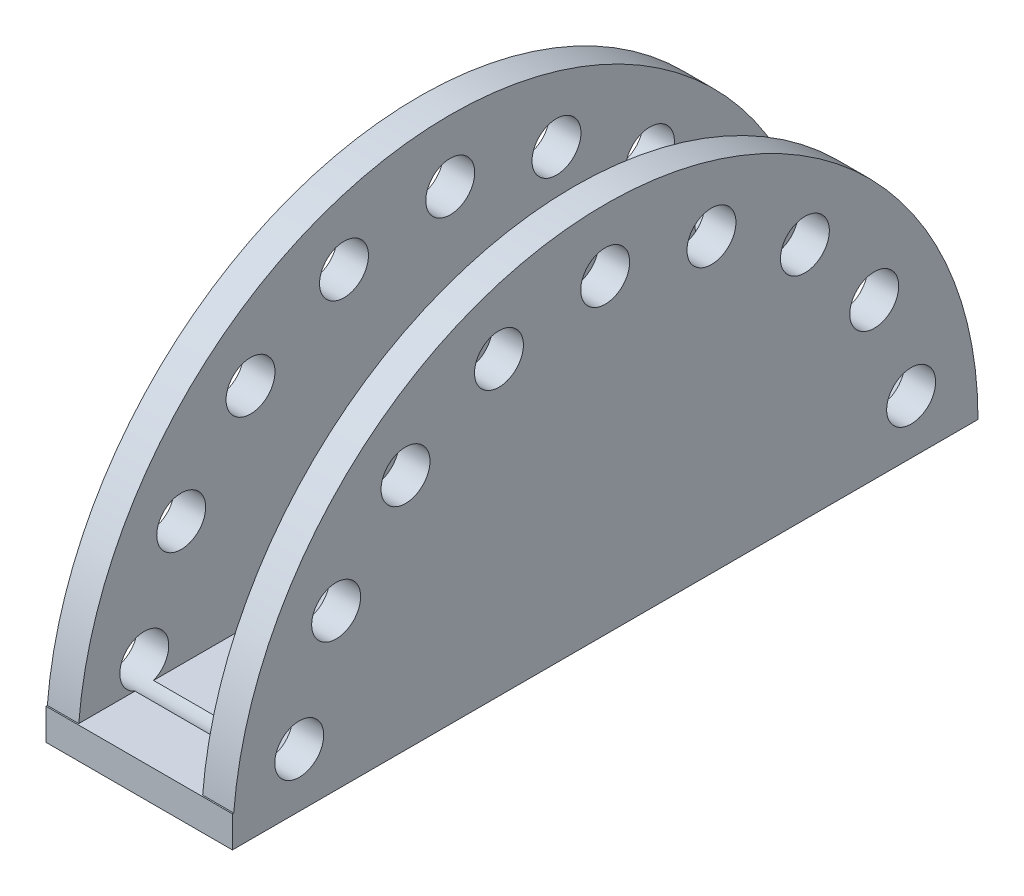
ISO-10303-21;
HEADER;
FILE_DESCRIPTION(('STEP AP214'),'2;1');
FILE_NAME('part.step','',(''),(''),'','','');
FILE_SCHEMA(('AUTOMOTIVE_DESIGN { 1 0 10303 214 1 1 1 1 }'));
ENDSEC;
DATA;
#1=APPLICATION_CONTEXT('core data for automotive mechanical design processes');
#2=APPLICATION_PROTOCOL_DEFINITION('international standard','automotive_design',2000,#1);
#3=PRODUCT_CONTEXT('',#1,'mechanical');
#4=PRODUCT('Part','Part','',(#3));
#5=PRODUCT_RELATED_PRODUCT_CATEGORY('part','',(#4));
#6=PRODUCT_DEFINITION_FORMATION('','',#4);
#7=PRODUCT_DEFINITION_CONTEXT('part definition',#1,'design');
#8=PRODUCT_DEFINITION('design','',#6,#7);
#9=PRODUCT_DEFINITION_SHAPE('','',#8);
#10=(LENGTH_UNIT() NAMED_UNIT(*) SI_UNIT(.MILLI.,.METRE.));
#11=(NAMED_UNIT(*) PLANE_ANGLE_UNIT() SI_UNIT($,.RADIAN.));
#12=(NAMED_UNIT(*) SI_UNIT($,.STERADIAN.) SOLID_ANGLE_UNIT());
#13=UNCERTAINTY_MEASURE_WITH_UNIT(LENGTH_MEASURE(1.E-05),#10,'distance_accuracy_value','');
#14=(GEOMETRIC_REPRESENTATION_CONTEXT(3) GLOBAL_UNCERTAINTY_ASSIGNED_CONTEXT((#13)) GLOBAL_UNIT_ASSIGNED_CONTEXT((#10,
#11,#12)) REPRESENTATION_CONTEXT('',''));
#15=CARTESIAN_POINT('',(0.,0.,0.));
#16=DIRECTION('',(0.,0.,1.));
#17=DIRECTION('',(1.,0.,0.));
#18=AXIS2_PLACEMENT_3D('',#15,#16,#17);
#19=CARTESIAN_POINT('',(0.,6.39880468947176,76.2));
#20=DIRECTION('',(0.,1.,0.));
#21=DIRECTION('',(0.,0.,1.));
#22=AXIS2_PLACEMENT_3D('',#19,#20,#21);
#23=PLANE('',#22);
#24=DIRECTION('',(1.,0.,0.));
#25=VECTOR('',#24,1.);
#26=CARTESIAN_POINT('',(0.,6.39880468947176,64.4281707783196));
#27=LINE('',#26,#25);
#28=CARTESIAN_POINT('',(6.42620000000001,6.39880468947176,64.4281707783196));
#29=VERTEX_POINT('',#28);
#30=CARTESIAN_POINT('',(31.75,6.39880468947176,64.4281707783196));
#31=VERTEX_POINT('',#30);
#32=EDGE_CURVE('E51',#29,#31,#27,.T.);
#33=ORIENTED_EDGE('',*,*,#32,.F.);
#34=DIRECTION('',(0.,0.,-1.));
#35=VECTOR('',#34,1.);
#36=CARTESIAN_POINT('',(6.4262,6.39880468947177,80.2386556935392));
#37=LINE('',#36,#35);
#38=CARTESIAN_POINT('',(6.4262,6.39880468947176,75.9308586712016));
#39=VERTEX_POINT('',#38);
#40=EDGE_CURVE('E187',#39,#29,#37,.T.);
#41=ORIENTED_EDGE('',*,*,#40,.F.);
#42=DIRECTION('',(-1.,0.,0.));
#43=VECTOR('',#42,1.);
#44=CARTESIAN_POINT('',(38.1,6.39880468947176,75.9308586712016));
#45=LINE('',#44,#43);
#46=CARTESIAN_POINT('',(0.,6.39880468947176,75.9308586712016));
#47=VERTEX_POINT('',#46);
#48=EDGE_CURVE('E160',#47,#39,#45,.F.);
#49=ORIENTED_EDGE('',*,*,#48,.F.);
#50=DIRECTION('',(0.,0.,1.));
#51=VECTOR('',#50,1.);
#52=CARTESIAN_POINT('',(0.,6.39880468947176,76.2));
#53=LINE('',#52,#51);
#54=CARTESIAN_POINT('',(0.,6.39880468947176,76.2));
#55=VERTEX_POINT('',#54);
#56=EDGE_CURVE('E147',#47,#55,#53,.T.);
#57=ORIENTED_EDGE('',*,*,#56,.T.);
#58=DIRECTION('',(1.,0.,0.));
#59=VECTOR('',#58,1.);
#60=CARTESIAN_POINT('',(0.,6.39880468947176,76.2));
#61=LINE('',#60,#59);
#62=CARTESIAN_POINT('',(38.1,6.39880468947176,76.2));
#63=VERTEX_POINT('',#62);
#64=EDGE_CURVE('E157',#55,#63,#61,.T.);
#65=ORIENTED_EDGE('',*,*,#64,.T.);
#66=DIRECTION('',(0.,0.,1.));
#67=VECTOR('',#66,1.);
#68=CARTESIAN_POINT('',(38.1,6.39880468947176,76.2));
#69=LINE('',#68,#67);
#70=CARTESIAN_POINT('',(38.1,6.39880468947176,75.9308586712016));
#71=VERTEX_POINT('',#70);
#72=EDGE_CURVE('E148',#71,#63,#69,.T.);
#73=ORIENTED_EDGE('',*,*,#72,.F.);
#74=DIRECTION('',(-1.,0.,0.));
#75=VECTOR('',#74,1.);
#76=CARTESIAN_POINT('',(38.1,6.39880468947176,75.9308586712016));
#77=LINE('',#76,#75);
#78=CARTESIAN_POINT('',(31.75,6.39880468947176,75.9308586712016));
#79=VERTEX_POINT('',#78);
#80=EDGE_CURVE('E301',#71,#79,#77,.T.);
#81=ORIENTED_EDGE('',*,*,#80,.T.);
#82=DIRECTION('',(0.,0.,-1.));
#83=VECTOR('',#82,1.);
#84=CARTESIAN_POINT('',(31.75,6.39880468947176,76.2));
#85=LINE('',#84,#83);
#86=EDGE_CURVE('E136',#79,#31,#85,.T.);
#87=ORIENTED_EDGE('',*,*,#86,.T.);
#88=EDGE_LOOP('',(#33,#41,#49,#57,#65,#73,#81,#87));
#89=FACE_BOUND('',#88,.T.);
#90=ADVANCED_FACE('F34',(#89),#23,.T.);
#91=DIRECTION('',(1.,0.,0.));
#92=VECTOR('',#91,1.);
#93=CARTESIAN_POINT('',(0.,6.39880468947176,60.642413854206));
#94=LINE('',#93,#92);
#95=CARTESIAN_POINT('',(31.75,6.39880468947176,60.642413854206));
#96=VERTEX_POINT('',#95);
#97=CARTESIAN_POINT('',(6.42620000000001,6.39880468947176,60.642413854206));
#98=VERTEX_POINT('',#97);
#99=EDGE_CURVE('E124',#96,#98,#94,.F.);
#100=ORIENTED_EDGE('',*,*,#99,.F.);
#101=CARTESIAN_POINT('',(31.75,6.39880468947176,-60.6424138543283));
#102=VERTEX_POINT('',#101);
#103=EDGE_CURVE('E58',#96,#102,#85,.T.);
#104=ORIENTED_EDGE('',*,*,#103,.T.);
#105=DIRECTION('',(1.,0.,0.));
#106=VECTOR('',#105,1.);
#107=CARTESIAN_POINT('',(0.,6.39880468947176,-60.6424138543283));
#108=LINE('',#107,#106);
#109=CARTESIAN_POINT('',(6.42620000000001,6.39880468947176,-60.6424138543283));
#110=VERTEX_POINT('',#109);
#111=EDGE_CURVE('E257',#110,#102,#108,.T.);
#112=ORIENTED_EDGE('',*,*,#111,.F.);
#113=EDGE_CURVE('E130',#98,#110,#37,.T.);
#114=ORIENTED_EDGE('',*,*,#113,.F.);
#115=EDGE_LOOP('',(#100,#104,#112,#114));
#116=FACE_BOUND('',#115,.T.);
#117=ADVANCED_FACE('F129',(#116),#23,.T.);
#118=DIRECTION('',(1.,0.,0.));
#119=VECTOR('',#118,1.);
#120=CARTESIAN_POINT('',(0.,6.39880468947176,-64.4281707782472));
#121=LINE('',#120,#119);
#122=CARTESIAN_POINT('',(31.75,6.39880468947176,-64.4281707782472));
#123=VERTEX_POINT('',#122);
#124=CARTESIAN_POINT('',(6.42620000000001,6.39880468947176,-64.4281707782472));
#125=VERTEX_POINT('',#124);
#126=EDGE_CURVE('E253',#123,#125,#121,.F.);
#127=ORIENTED_EDGE('',*,*,#126,.F.);
#128=CARTESIAN_POINT('',(31.75,6.39880468947186,-75.9308586712016));
#129=VERTEX_POINT('',#128);
#130=EDGE_CURVE('E137',#123,#129,#85,.T.);
#131=ORIENTED_EDGE('',*,*,#130,.T.);
#132=DIRECTION('',(1.,0.,0.));
#133=VECTOR('',#132,1.);
#134=CARTESIAN_POINT('',(0.,6.39880468947176,-75.9308586712016));
#135=LINE('',#134,#133);
#136=CARTESIAN_POINT('',(6.42620000000002,6.39880468947176,-75.9308586712016));
#137=VERTEX_POINT('',#136);
#138=EDGE_CURVE('E161',#137,#129,#135,.T.);
#139=ORIENTED_EDGE('',*,*,#138,.F.);
#140=EDGE_CURVE('E186',#125,#137,#37,.T.);
#141=ORIENTED_EDGE('',*,*,#140,.F.);
#142=EDGE_LOOP('',(#127,#131,#139,#141));
#143=FACE_BOUND('',#142,.T.);
#144=ADVANCED_FACE('F326',(#143),#23,.T.);
#145=CARTESIAN_POINT('',(0.,-5.32101756039693E-13,-75.9308586712016));
#146=DIRECTION('',(0.,0.,-1.));
#147=DIRECTION('',(-1.,0.,0.));
#148=AXIS2_PLACEMENT_3D('',#145,#146,#147);
#149=PLANE('',#148);
#150=ORIENTED_EDGE('',*,*,#138,.T.);
#151=DIRECTION('',(0.,-1.,0.));
#152=VECTOR('',#151,1.);
#153=CARTESIAN_POINT('',(31.75,-5.32101756039693E-13,-75.9308586712016));
#154=LINE('',#153,#152);
#155=CARTESIAN_POINT('',(31.75,-5.32101756039693E-13,-75.9308586712016));
#156=VERTEX_POINT('',#155);
#157=EDGE_CURVE('E140',#129,#156,#154,.T.);
#158=ORIENTED_EDGE('',*,*,#157,.T.);
#159=DIRECTION('',(1.,0.,0.));
#160=VECTOR('',#159,1.);
#161=CARTESIAN_POINT('',(0.,-5.32101756039693E-13,-75.9308586712016));
#162=LINE('',#161,#160);
#163=CARTESIAN_POINT('',(6.42620000000001,-5.32101756039693E-13,-75.9308586712016));
#164=VERTEX_POINT('',#163);
#165=EDGE_CURVE('E150',#164,#156,#162,.T.);
#166=ORIENTED_EDGE('',*,*,#165,.F.);
#167=DIRECTION('',(0.,-1.,0.));
#168=VECTOR('',#167,1.);
#169=CARTESIAN_POINT('',(6.42620000000002,76.2,-75.9308586712016));
#170=LINE('',#169,#168);
#171=EDGE_CURVE('E177',#137,#164,#170,.T.);
#172=ORIENTED_EDGE('',*,*,#171,.F.);
#173=EDGE_LOOP('',(#150,#158,#166,#172));
#174=FACE_BOUND('',#173,.T.);
#175=ADVANCED_FACE('F308',(#174),#149,.T.);
#176=CARTESIAN_POINT('',(6.4262,76.2,80.2386556935392));
#177=DIRECTION('',(-1.,0.,0.));
#178=DIRECTION('',(0.,0.,1.));
#179=AXIS2_PLACEMENT_3D('',#176,#177,#178);
#180=PLANE('',#179);
#181=CARTESIAN_POINT('',(6.42620000000001,59.6704814199,21.7182791011791));
#182=DIRECTION('',(-1.,0.,0.));
#183=DIRECTION('',(0.,0.,1.));
#184=AXIS2_PLACEMENT_3D('',#181,#182,#183);
#185=CIRCLE('',#184,5.00000270000322);
#186=CARTESIAN_POINT('',(6.42620000000001,59.6704814199,26.7182818011823));
#187=VERTEX_POINT('',#186);
#188=EDGE_CURVE('E230',#187,#187,#185,.T.);
#189=ORIENTED_EDGE('',*,*,#188,.T.);
#190=EDGE_LOOP('',(#189));
#191=FACE_BOUND('',#190,.T.);
#192=CARTESIAN_POINT('',(6.42620000000001,48.6438221380454,40.8170132150918));
#193=DIRECTION('',(-1.,0.,0.));
#194=DIRECTION('',(0.,0.,1.));
#195=AXIS2_PLACEMENT_3D('',#192,#193,#194);
#196=CIRCLE('',#195,5.00000270000702);
#197=CARTESIAN_POINT('',(6.4262,48.6438221380454,45.8170159150988));
#198=VERTEX_POINT('',#197);
#199=EDGE_CURVE('E217',#198,#198,#196,.T.);
#200=ORIENTED_EDGE('',*,*,#199,.T.);
#201=EDGE_LOOP('',(#200));
#202=FACE_BOUND('',#201,.T.);
#203=CARTESIAN_POINT('',(6.4262,31.7499999999869,54.9926131403044));
#204=DIRECTION('',(-1.,0.,0.));
#205=DIRECTION('',(0.,0.,1.));
#206=AXIS2_PLACEMENT_3D('',#203,#204,#205);
#207=CIRCLE('',#206,5.00000270001179);
#208=CARTESIAN_POINT('',(6.4262,31.7499999999869,59.9926158403162));
#209=VERTEX_POINT('',#208);
#210=EDGE_CURVE('E213',#209,#209,#207,.T.);
#211=ORIENTED_EDGE('',*,*,#210,.T.);
#212=EDGE_LOOP('',(#211));
#213=FACE_BOUND('',#212,.T.);
#214=CARTESIAN_POINT('',(6.42620000000002,31.7500000000131,-54.9926131403195));
#215=DIRECTION('',(-1.,0.,0.));
#216=DIRECTION('',(0.,0.,1.));
#217=AXIS2_PLACEMENT_3D('',#214,#215,#216);
#218=CIRCLE('',#217,5.00000270000348);
#219=CARTESIAN_POINT('',(6.42620000000002,31.7500000000131,-49.992610440316));
#220=VERTEX_POINT('',#219);
#221=EDGE_CURVE('E208',#220,#220,#218,.T.);
#222=ORIENTED_EDGE('',*,*,#221,.T.);
#223=EDGE_LOOP('',(#222));
#224=FACE_BOUND('',#223,.T.);
#225=CARTESIAN_POINT('',(6.42620000000001,48.6438221380648,-40.8170132150988));
#226=DIRECTION('',(-1.,0.,0.));
#227=DIRECTION('',(0.,0.,1.));
#228=AXIS2_PLACEMENT_3D('',#225,#226,#227);
#229=CIRCLE('',#228,5.00000270000058);
#230=CARTESIAN_POINT('',(6.42620000000001,48.6438221380648,-35.8170105150983));
#231=VERTEX_POINT('',#230);
#232=EDGE_CURVE('E203',#231,#231,#229,.T.);
#233=ORIENTED_EDGE('',*,*,#232,.T.);
#234=EDGE_LOOP('',(#233));
#235=FACE_BOUND('',#234,.T.);
#236=CARTESIAN_POINT('',(6.42620000000001,59.6704814199103,-21.7182791011809));
#237=DIRECTION('',(-1.,0.,0.));
#238=DIRECTION('',(0.,0.,1.));
#239=AXIS2_PLACEMENT_3D('',#236,#237,#238);
#240=CIRCLE('',#239,5.00000269999941);
#241=CARTESIAN_POINT('',(6.42620000000001,59.6704814199103,-16.7182764011815));
#242=VERTEX_POINT('',#241);
#243=EDGE_CURVE('E198',#242,#242,#240,.T.);
#244=ORIENTED_EDGE('',*,*,#243,.T.);
#245=EDGE_LOOP('',(#244));
#246=FACE_BOUND('',#245,.T.);
#247=CARTESIAN_POINT('',(6.42620000000001,63.5,0.));
#248=DIRECTION('',(-1.,0.,0.));
#249=DIRECTION('',(0.,0.,1.));
#250=AXIS2_PLACEMENT_3D('',#247,#248,#249);
#251=CIRCLE('',#250,5.0000027);
#252=CARTESIAN_POINT('',(6.42620000000001,63.5,5.0000027));
#253=VERTEX_POINT('',#252);
#254=EDGE_CURVE('E193',#253,#253,#251,.T.);
#255=ORIENTED_EDGE('',*,*,#254,.T.);
#256=EDGE_LOOP('',(#255));
#257=FACE_BOUND('',#256,.T.);
#258=ORIENTED_EDGE('',*,*,#40,.T.);
#259=CARTESIAN_POINT('',(6.4262,11.0266592818351,62.5352923162628));
#260=DIRECTION('',(-1.,0.,0.));
#261=DIRECTION('',(0.,0.,1.));
#262=AXIS2_PLACEMENT_3D('',#259,#260,#261);
#263=CIRCLE('',#262,5.00000270001698);
#264=EDGE_CURVE('E247',#29,#98,#263,.T.);
#265=ORIENTED_EDGE('',*,*,#264,.T.);
#266=ORIENTED_EDGE('',*,*,#113,.T.);
#267=CARTESIAN_POINT('',(6.42620000000002,11.0266592818649,-62.5352923162878));
#268=DIRECTION('',(-1.,0.,0.));
#269=DIRECTION('',(0.,0.,1.));
#270=AXIS2_PLACEMENT_3D('',#267,#268,#269);
#271=CIRCLE('',#270,5.00000270000769);
#272=EDGE_CURVE('E259',#110,#125,#271,.T.);
#273=ORIENTED_EDGE('',*,*,#272,.T.);
#274=ORIENTED_EDGE('',*,*,#140,.T.);
#275=CARTESIAN_POINT('',(6.42620000000001,0.,0.));
#276=DIRECTION('',(-1.,0.,0.));
#277=DIRECTION('',(0.,0.,1.));
#278=AXIS2_PLACEMENT_3D('',#275,#276,#277);
#279=CIRCLE('',#278,76.2);
#280=EDGE_CURVE('E180',#39,#137,#279,.T.);
#281=ORIENTED_EDGE('',*,*,#280,.F.);
#282=EDGE_LOOP('',(#258,#265,#266,#273,#274,#281));
#283=FACE_BOUND('',#282,.T.);
#284=ADVANCED_FACE('F356',(#191,#202,#213,#224,#235,#246,#257,#283),#180,.F.);
#285=CARTESIAN_POINT('',(38.1,0.,76.2));
#286=DIRECTION('',(0.,1.,0.));
#287=DIRECTION('',(0.,0.,1.));
#288=AXIS2_PLACEMENT_3D('',#285,#286,#287);
#289=PLANE('',#288);
#290=DIRECTION('',(-1.,0.,0.));
#291=VECTOR('',#290,1.);
#292=CARTESIAN_POINT('',(38.1,0.,76.2));
#293=LINE('',#292,#291);
#294=CARTESIAN_POINT('',(38.1,-5.32101756039693E-13,76.2));
#295=VERTEX_POINT('',#294);
#296=CARTESIAN_POINT('',(0.,-5.32101756039693E-13,76.2));
#297=VERTEX_POINT('',#296);
#298=EDGE_CURVE('E171',#295,#297,#293,.T.);
#299=ORIENTED_EDGE('',*,*,#298,.T.);
#300=DIRECTION('',(0.,0.,-1.));
#301=VECTOR('',#300,1.);
#302=CARTESIAN_POINT('',(0.,0.,76.2));
#303=LINE('',#302,#301);
#304=CARTESIAN_POINT('',(0.,0.,-76.2));
#305=VERTEX_POINT('',#304);
#306=EDGE_CURVE('E172',#297,#305,#303,.T.);
#307=ORIENTED_EDGE('',*,*,#306,.T.);
#308=DIRECTION('',(-1.,0.,0.));
#309=VECTOR('',#308,1.);
#310=CARTESIAN_POINT('',(38.1,0.,-76.2));
#311=LINE('',#310,#309);
#312=CARTESIAN_POINT('',(6.42620000000002,0.,-76.2));
#313=VERTEX_POINT('',#312);
#314=EDGE_CURVE('E178',#313,#305,#311,.T.);
#315=ORIENTED_EDGE('',*,*,#314,.F.);
#316=DIRECTION('',(0.,0.,1.));
#317=VECTOR('',#316,1.);
#318=CARTESIAN_POINT('',(6.4262,0.,76.2));
#319=LINE('',#318,#317);
#320=EDGE_CURVE('E168',#313,#164,#319,.T.);
#321=ORIENTED_EDGE('',*,*,#320,.T.);
#322=ORIENTED_EDGE('',*,*,#165,.T.);
#323=DIRECTION('',(0.,0.,-1.));
#324=VECTOR('',#323,1.);
#325=CARTESIAN_POINT('',(31.75,0.,76.2));
#326=LINE('',#325,#324);
#327=CARTESIAN_POINT('',(31.75,0.,-76.2));
#328=VERTEX_POINT('',#327);
#329=EDGE_CURVE('E300',#156,#328,#326,.T.);
#330=ORIENTED_EDGE('',*,*,#329,.T.);
#331=DIRECTION('',(-1.,0.,0.));
#332=VECTOR('',#331,1.);
#333=CARTESIAN_POINT('',(38.1,0.,-76.2));
#334=LINE('',#333,#332);
#335=CARTESIAN_POINT('',(38.1,0.,-76.2));
#336=VERTEX_POINT('',#335);
#337=EDGE_CURVE('E297',#336,#328,#334,.T.);
#338=ORIENTED_EDGE('',*,*,#337,.F.);
#339=DIRECTION('',(0.,0.,-1.));
#340=VECTOR('',#339,1.);
#341=CARTESIAN_POINT('',(38.1,-5.32101756039693E-13,76.2));
#342=LINE('',#341,#340);
#343=EDGE_CURVE('E153',#295,#336,#342,.T.);
#344=ORIENTED_EDGE('',*,*,#343,.F.);
#345=EDGE_LOOP('',(#299,#307,#315,#321,#322,#330,#338,#344));
#346=FACE_BOUND('',#345,.T.);
#347=ADVANCED_FACE('F315',(#346),#289,.F.);
#348=CARTESIAN_POINT('',(38.1,0.,0.));
#349=DIRECTION('',(-1.,0.,0.));
#350=DIRECTION('',(0.,0.,1.));
#351=AXIS2_PLACEMENT_3D('',#348,#349,#350);
#352=CYLINDRICAL_SURFACE('',#351,76.2);
#353=CARTESIAN_POINT('',(0.,0.,0.));
#354=DIRECTION('',(1.,0.,0.));
#355=DIRECTION('',(0.,0.,-1.));
#356=AXIS2_PLACEMENT_3D('',#353,#354,#355);
#357=CIRCLE('',#356,76.2);
#358=EDGE_CURVE('E175',#305,#47,#357,.T.);
#359=ORIENTED_EDGE('',*,*,#358,.T.);
#360=ORIENTED_EDGE('',*,*,#48,.T.);
#361=ORIENTED_EDGE('',*,*,#280,.T.);
#362=EDGE_CURVE('E174',#137,#313,#279,.T.);
#363=ORIENTED_EDGE('',*,*,#362,.T.);
#364=ORIENTED_EDGE('',*,*,#314,.T.);
#365=EDGE_LOOP('',(#359,#360,#361,#363,#364));
#366=FACE_BOUND('',#365,.T.);
#367=ADVANCED_FACE('F36',(#366),#352,.T.);
#368=CARTESIAN_POINT('',(0.,0.,0.));
#369=DIRECTION('',(1.,0.,0.));
#370=DIRECTION('',(0.,0.,-1.));
#371=AXIS2_PLACEMENT_3D('',#368,#369,#370);
#372=PLANE('',#371);
#373=CARTESIAN_POINT('',(0.,59.6704814199,21.7182791011791));
#374=DIRECTION('',(1.,0.,0.));
#375=DIRECTION('',(0.,0.,-1.));
#376=AXIS2_PLACEMENT_3D('',#373,#374,#375);
#377=CIRCLE('',#376,5.00000270000322);
#378=CARTESIAN_POINT('',(0.,59.6704814199,16.7182764011759));
#379=VERTEX_POINT('',#378);
#380=EDGE_CURVE('E468',#379,#379,#377,.T.);
#381=ORIENTED_EDGE('',*,*,#380,.T.);
#382=EDGE_LOOP('',(#381));
#383=FACE_BOUND('',#382,.T.);
#384=CARTESIAN_POINT('',(0.,48.6438221380454,40.8170132150918));
#385=DIRECTION('',(1.,0.,0.));
#386=DIRECTION('',(0.,0.,-1.));
#387=AXIS2_PLACEMENT_3D('',#384,#385,#386);
#388=CIRCLE('',#387,5.00000270000702);
#389=CARTESIAN_POINT('',(0.,48.6438221380454,35.8170105150848));
#390=VERTEX_POINT('',#389);
#391=EDGE_CURVE('E218',#390,#390,#388,.T.);
#392=ORIENTED_EDGE('',*,*,#391,.T.);
#393=EDGE_LOOP('',(#392));
#394=FACE_BOUND('',#393,.T.);
#395=CARTESIAN_POINT('',(0.,31.7499999999869,54.9926131403044));
#396=DIRECTION('',(1.,0.,0.));
#397=DIRECTION('',(0.,0.,-1.));
#398=AXIS2_PLACEMENT_3D('',#395,#396,#397);
#399=CIRCLE('',#398,5.00000270001179);
#400=CARTESIAN_POINT('',(0.,31.7499999999869,49.9926104402926));
#401=VERTEX_POINT('',#400);
#402=EDGE_CURVE('E214',#401,#401,#399,.T.);
#403=ORIENTED_EDGE('',*,*,#402,.T.);
#404=EDGE_LOOP('',(#403));
#405=FACE_BOUND('',#404,.T.);
#406=CARTESIAN_POINT('',(0.,11.0266592818351,62.5352923162628));
#407=DIRECTION('',(1.,0.,0.));
#408=DIRECTION('',(0.,0.,-1.));
#409=AXIS2_PLACEMENT_3D('',#406,#407,#408);
#410=CIRCLE('',#409,5.00000270001698);
#411=CARTESIAN_POINT('',(0.,11.0266592818351,57.5352896162458));
#412=VERTEX_POINT('',#411);
#413=EDGE_CURVE('E131',#412,#412,#410,.T.);
#414=ORIENTED_EDGE('',*,*,#413,.T.);
#415=EDGE_LOOP('',(#414));
#416=FACE_BOUND('',#415,.T.);
#417=CARTESIAN_POINT('',(0.,11.0266592818649,-62.5352923162878));
#418=DIRECTION('',(1.,0.,0.));
#419=DIRECTION('',(0.,0.,-1.));
#420=AXIS2_PLACEMENT_3D('',#417,#418,#419);
#421=CIRCLE('',#420,5.00000270000769);
#422=CARTESIAN_POINT('',(0.,11.0266592818649,-67.5352950162955));
#423=VERTEX_POINT('',#422);
#424=EDGE_CURVE('E250',#423,#423,#421,.T.);
#425=ORIENTED_EDGE('',*,*,#424,.T.);
#426=EDGE_LOOP('',(#425));
#427=FACE_BOUND('',#426,.T.);
#428=CARTESIAN_POINT('',(0.,31.7500000000131,-54.9926131403195));
#429=DIRECTION('',(1.,0.,0.));
#430=DIRECTION('',(0.,0.,-1.));
#431=AXIS2_PLACEMENT_3D('',#428,#429,#430);
#432=CIRCLE('',#431,5.00000270000348);
#433=CARTESIAN_POINT('',(0.,31.7500000000131,-59.9926158403229));
#434=VERTEX_POINT('',#433);
#435=EDGE_CURVE('E209',#434,#434,#432,.T.);
#436=ORIENTED_EDGE('',*,*,#435,.T.);
#437=EDGE_LOOP('',(#436));
#438=FACE_BOUND('',#437,.T.);
#439=CARTESIAN_POINT('',(0.,48.6438221380648,-40.8170132150988));
#440=DIRECTION('',(1.,0.,0.));
#441=DIRECTION('',(0.,0.,-1.));
#442=AXIS2_PLACEMENT_3D('',#439,#440,#441);
#443=CIRCLE('',#442,5.00000270000058);
#444=CARTESIAN_POINT('',(0.,48.6438221380648,-45.8170159150994));
#445=VERTEX_POINT('',#444);
#446=EDGE_CURVE('E204',#445,#445,#443,.T.);
#447=ORIENTED_EDGE('',*,*,#446,.T.);
#448=EDGE_LOOP('',(#447));
#449=FACE_BOUND('',#448,.T.);
#450=CARTESIAN_POINT('',(0.,59.6704814199103,-21.7182791011809));
#451=DIRECTION('',(1.,0.,0.));
#452=DIRECTION('',(0.,0.,-1.));
#453=AXIS2_PLACEMENT_3D('',#450,#451,#452);
#454=CIRCLE('',#453,5.00000269999941);
#455=CARTESIAN_POINT('',(0.,59.6704814199103,-26.7182818011803));
#456=VERTEX_POINT('',#455);
#457=EDGE_CURVE('E199',#456,#456,#454,.T.);
#458=ORIENTED_EDGE('',*,*,#457,.T.);
#459=EDGE_LOOP('',(#458));
#460=FACE_BOUND('',#459,.T.);
#461=CARTESIAN_POINT('',(0.,63.5,0.));
#462=DIRECTION('',(1.,0.,0.));
#463=DIRECTION('',(0.,0.,-1.));
#464=AXIS2_PLACEMENT_3D('',#461,#462,#463);
#465=CIRCLE('',#464,5.0000027);
#466=CARTESIAN_POINT('',(0.,63.5,-5.0000027));
#467=VERTEX_POINT('',#466);
#468=EDGE_CURVE('E194',#467,#467,#465,.T.);
#469=ORIENTED_EDGE('',*,*,#468,.T.);
#470=EDGE_LOOP('',(#469));
#471=FACE_BOUND('',#470,.T.);
#472=ORIENTED_EDGE('',*,*,#358,.F.);
#473=ORIENTED_EDGE('',*,*,#306,.F.);
#474=DIRECTION('',(0.,-1.,0.));
#475=VECTOR('',#474,1.);
#476=CARTESIAN_POINT('',(0.,-5.32101756039693E-13,76.2));
#477=LINE('',#476,#475);
#478=EDGE_CURVE('E144',#55,#297,#477,.T.);
#479=ORIENTED_EDGE('',*,*,#478,.F.);
#480=ORIENTED_EDGE('',*,*,#56,.F.);
#481=EDGE_LOOP('',(#472,#473,#479,#480));
#482=FACE_BOUND('',#481,.T.);
#483=ADVANCED_FACE('F367',(#383,#394,#405,#416,#427,#438,#449,#460,#471,#482),#372,.F.);
#484=ORIENTED_EDGE('',*,*,#362,.F.);
#485=ORIENTED_EDGE('',*,*,#171,.T.);
#486=ORIENTED_EDGE('',*,*,#320,.F.);
#487=EDGE_LOOP('',(#484,#485,#486));
#488=FACE_BOUND('',#487,.T.);
#489=ADVANCED_FACE('F321',(#488),#180,.F.);
#490=CARTESIAN_POINT('',(0.,-5.32101756039693E-13,76.2));
#491=DIRECTION('',(0.,0.,1.));
#492=DIRECTION('',(1.,0.,0.));
#493=AXIS2_PLACEMENT_3D('',#490,#491,#492);
#494=PLANE('',#493);
#495=DIRECTION('',(0.,-1.,0.));
#496=VECTOR('',#495,1.);
#497=CARTESIAN_POINT('',(38.1,-5.32101756039693E-13,76.2));
#498=LINE('',#497,#496);
#499=EDGE_CURVE('E139',#63,#295,#498,.T.);
#500=ORIENTED_EDGE('',*,*,#499,.F.);
#501=ORIENTED_EDGE('',*,*,#64,.F.);
#502=ORIENTED_EDGE('',*,*,#478,.T.);
#503=ORIENTED_EDGE('',*,*,#298,.F.);
#504=EDGE_LOOP('',(#500,#501,#502,#503));
#505=FACE_BOUND('',#504,.T.);
#506=ADVANCED_FACE('F363',(#505),#494,.T.);
#507=CARTESIAN_POINT('',(38.1,0.,0.));
#508=DIRECTION('',(-1.,0.,0.));
#509=DIRECTION('',(0.,0.,1.));
#510=AXIS2_PLACEMENT_3D('',#507,#508,#509);
#511=PLANE('',#510);
#512=CARTESIAN_POINT('',(38.1,59.6704814199,21.7182791011791));
#513=DIRECTION('',(1.,0.,0.));
#514=DIRECTION('',(0.,0.,-1.));
#515=AXIS2_PLACEMENT_3D('',#512,#513,#514);
#516=CIRCLE('',#515,5.00000270000322);
#517=CARTESIAN_POINT('',(38.1,59.6704814199,16.7182764011759));
#518=VERTEX_POINT('',#517);
#519=EDGE_CURVE('E396',#518,#518,#516,.T.);
#520=ORIENTED_EDGE('',*,*,#519,.F.);
#521=EDGE_LOOP('',(#520));
#522=FACE_BOUND('',#521,.T.);
#523=CARTESIAN_POINT('',(38.1,48.6438221380454,40.8170132150918));
#524=DIRECTION('',(1.,0.,0.));
#525=DIRECTION('',(0.,0.,-1.));
#526=AXIS2_PLACEMENT_3D('',#523,#524,#525);
#527=CIRCLE('',#526,5.00000270000702);
#528=CARTESIAN_POINT('',(38.1,48.6438221380454,35.8170105150848));
#529=VERTEX_POINT('',#528);
#530=EDGE_CURVE('E225',#529,#529,#527,.T.);
#531=ORIENTED_EDGE('',*,*,#530,.F.);
#532=EDGE_LOOP('',(#531));
#533=FACE_BOUND('',#532,.T.);
#534=CARTESIAN_POINT('',(38.1,31.7499999999869,54.9926131403044));
#535=DIRECTION('',(1.,0.,0.));
#536=DIRECTION('',(0.,0.,-1.));
#537=AXIS2_PLACEMENT_3D('',#534,#535,#536);
#538=CIRCLE('',#537,5.00000270001179);
#539=CARTESIAN_POINT('',(38.1,31.7499999999869,49.9926104402926));
#540=VERTEX_POINT('',#539);
#541=EDGE_CURVE('E222',#540,#540,#538,.T.);
#542=ORIENTED_EDGE('',*,*,#541,.F.);
#543=EDGE_LOOP('',(#542));
#544=FACE_BOUND('',#543,.T.);
#545=CARTESIAN_POINT('',(38.1,11.0266592818351,62.5352923162628));
#546=DIRECTION('',(1.,0.,0.));
#547=DIRECTION('',(0.,0.,-1.));
#548=AXIS2_PLACEMENT_3D('',#545,#546,#547);
#549=CIRCLE('',#548,5.00000270001698);
#550=CARTESIAN_POINT('',(38.1,11.0266592818351,57.5352896162458));
#551=VERTEX_POINT('',#550);
#552=EDGE_CURVE('E241',#551,#551,#549,.T.);
#553=ORIENTED_EDGE('',*,*,#552,.F.);
#554=EDGE_LOOP('',(#553));
#555=FACE_BOUND('',#554,.T.);
#556=CARTESIAN_POINT('',(38.1,11.0266592818649,-62.5352923162878));
#557=DIRECTION('',(1.,0.,0.));
#558=DIRECTION('',(0.,0.,-1.));
#559=AXIS2_PLACEMENT_3D('',#556,#557,#558);
#560=CIRCLE('',#559,5.00000270000769);
#561=CARTESIAN_POINT('',(38.1,11.0266592818649,-67.5352950162955));
#562=VERTEX_POINT('',#561);
#563=EDGE_CURVE('E249',#562,#562,#560,.T.);
#564=ORIENTED_EDGE('',*,*,#563,.F.);
#565=EDGE_LOOP('',(#564));
#566=FACE_BOUND('',#565,.T.);
#567=CARTESIAN_POINT('',(38.1,31.7500000000131,-54.9926131403195));
#568=DIRECTION('',(1.,0.,0.));
#569=DIRECTION('',(0.,0.,-1.));
#570=AXIS2_PLACEMENT_3D('',#567,#568,#569);
#571=CIRCLE('',#570,5.00000270000348);
#572=CARTESIAN_POINT('',(38.1,31.7500000000131,-59.9926158403229));
#573=VERTEX_POINT('',#572);
#574=EDGE_CURVE('E262',#573,#573,#571,.T.);
#575=ORIENTED_EDGE('',*,*,#574,.F.);
#576=EDGE_LOOP('',(#575));
#577=FACE_BOUND('',#576,.T.);
#578=CARTESIAN_POINT('',(38.1,48.6438221380648,-40.8170132150988));
#579=DIRECTION('',(1.,0.,0.));
#580=DIRECTION('',(0.,0.,-1.));
#581=AXIS2_PLACEMENT_3D('',#578,#579,#580);
#582=CIRCLE('',#581,5.00000270000058);
#583=CARTESIAN_POINT('',(38.1,48.6438221380648,-45.8170159150994));
#584=VERTEX_POINT('',#583);
#585=EDGE_CURVE('E269',#584,#584,#582,.T.);
#586=ORIENTED_EDGE('',*,*,#585,.F.);
#587=EDGE_LOOP('',(#586));
#588=FACE_BOUND('',#587,.T.);
#589=CARTESIAN_POINT('',(38.1,59.6704814199103,-21.7182791011809));
#590=DIRECTION('',(1.,0.,0.));
#591=DIRECTION('',(0.,0.,-1.));
#592=AXIS2_PLACEMENT_3D('',#589,#590,#591);
#593=CIRCLE('',#592,5.00000269999941);
#594=CARTESIAN_POINT('',(38.1,59.6704814199103,-26.7182818011803));
#595=VERTEX_POINT('',#594);
#596=EDGE_CURVE('E276',#595,#595,#593,.T.);
#597=ORIENTED_EDGE('',*,*,#596,.F.);
#598=EDGE_LOOP('',(#597));
#599=FACE_BOUND('',#598,.T.);
#600=CARTESIAN_POINT('',(38.1,63.5,0.));
#601=DIRECTION('',(1.,0.,0.));
#602=DIRECTION('',(0.,0.,-1.));
#603=AXIS2_PLACEMENT_3D('',#600,#601,#602);
#604=CIRCLE('',#603,5.0000027);
#605=CARTESIAN_POINT('',(38.1,63.5,-5.0000027));
#606=VERTEX_POINT('',#605);
#607=EDGE_CURVE('E283',#606,#606,#604,.T.);
#608=ORIENTED_EDGE('',*,*,#607,.F.);
#609=EDGE_LOOP('',(#608));
#610=FACE_BOUND('',#609,.T.);
#611=ORIENTED_EDGE('',*,*,#499,.T.);
#612=ORIENTED_EDGE('',*,*,#343,.T.);
#613=CARTESIAN_POINT('',(38.1,0.,0.));
#614=DIRECTION('',(1.,0.,0.));
#615=DIRECTION('',(0.,0.,-1.));
#616=AXIS2_PLACEMENT_3D('',#613,#614,#615);
#617=CIRCLE('',#616,76.2);
#618=EDGE_CURVE('E294',#336,#71,#617,.T.);
#619=ORIENTED_EDGE('',*,*,#618,.T.);
#620=ORIENTED_EDGE('',*,*,#72,.T.);
#621=EDGE_LOOP('',(#611,#612,#619,#620));
#622=FACE_BOUND('',#621,.T.);
#623=ADVANCED_FACE('F343',(#522,#533,#544,#555,#566,#577,#588,#599,#610,#622),#511,.F.);
#624=CARTESIAN_POINT('',(31.75,76.2,80.2386556935392));
#625=DIRECTION('',(1.,0.,0.));
#626=DIRECTION('',(0.,0.,-1.));
#627=AXIS2_PLACEMENT_3D('',#624,#625,#626);
#628=PLANE('',#627);
#629=CARTESIAN_POINT('',(31.75,59.6704814199,21.7182791011791));
#630=DIRECTION('',(1.,0.,0.));
#631=DIRECTION('',(0.,0.,-1.));
#632=AXIS2_PLACEMENT_3D('',#629,#630,#631);
#633=CIRCLE('',#632,5.00000270000322);
#634=CARTESIAN_POINT('',(31.75,59.6704814199,16.7182764011759));
#635=VERTEX_POINT('',#634);
#636=EDGE_CURVE('E38',#635,#635,#633,.T.);
#637=ORIENTED_EDGE('',*,*,#636,.T.);
#638=EDGE_LOOP('',(#637));
#639=FACE_BOUND('',#638,.T.);
#640=CARTESIAN_POINT('',(31.75,48.6438221380454,40.8170132150918));
#641=DIRECTION('',(1.,0.,0.));
#642=DIRECTION('',(0.,0.,-1.));
#643=AXIS2_PLACEMENT_3D('',#640,#641,#642);
#644=CIRCLE('',#643,5.00000270000702);
#645=CARTESIAN_POINT('',(31.75,48.6438221380454,35.8170105150848));
#646=VERTEX_POINT('',#645);
#647=EDGE_CURVE('E215',#646,#646,#644,.T.);
#648=ORIENTED_EDGE('',*,*,#647,.T.);
#649=EDGE_LOOP('',(#648));
#650=FACE_BOUND('',#649,.T.);
#651=CARTESIAN_POINT('',(31.75,31.7499999999869,54.9926131403044));
#652=DIRECTION('',(1.,0.,0.));
#653=DIRECTION('',(0.,0.,-1.));
#654=AXIS2_PLACEMENT_3D('',#651,#652,#653);
#655=CIRCLE('',#654,5.00000270001179);
#656=CARTESIAN_POINT('',(31.75,31.7499999999869,49.9926104402926));
#657=VERTEX_POINT('',#656);
#658=EDGE_CURVE('E211',#657,#657,#655,.T.);
#659=ORIENTED_EDGE('',*,*,#658,.T.);
#660=EDGE_LOOP('',(#659));
#661=FACE_BOUND('',#660,.T.);
#662=CARTESIAN_POINT('',(31.75,31.7500000000131,-54.9926131403195));
#663=DIRECTION('',(1.,0.,0.));
#664=DIRECTION('',(0.,0.,-1.));
#665=AXIS2_PLACEMENT_3D('',#662,#663,#664);
#666=CIRCLE('',#665,5.00000270000348);
#667=CARTESIAN_POINT('',(31.75,31.7500000000131,-59.9926158403229));
#668=VERTEX_POINT('',#667);
#669=EDGE_CURVE('E205',#668,#668,#666,.T.);
#670=ORIENTED_EDGE('',*,*,#669,.T.);
#671=EDGE_LOOP('',(#670));
#672=FACE_BOUND('',#671,.T.);
#673=CARTESIAN_POINT('',(31.75,48.6438221380648,-40.8170132150988));
#674=DIRECTION('',(1.,0.,0.));
#675=DIRECTION('',(0.,0.,-1.));
#676=AXIS2_PLACEMENT_3D('',#673,#674,#675);
#677=CIRCLE('',#676,5.00000270000058);
#678=CARTESIAN_POINT('',(31.75,48.6438221380648,-45.8170159150994));
#679=VERTEX_POINT('',#678);
#680=EDGE_CURVE('E200',#679,#679,#677,.T.);
#681=ORIENTED_EDGE('',*,*,#680,.T.);
#682=EDGE_LOOP('',(#681));
#683=FACE_BOUND('',#682,.T.);
#684=CARTESIAN_POINT('',(31.75,59.6704814199103,-21.7182791011809));
#685=DIRECTION('',(1.,0.,0.));
#686=DIRECTION('',(0.,0.,-1.));
#687=AXIS2_PLACEMENT_3D('',#684,#685,#686);
#688=CIRCLE('',#687,5.00000269999941);
#689=CARTESIAN_POINT('',(31.75,59.6704814199103,-26.7182818011803));
#690=VERTEX_POINT('',#689);
#691=EDGE_CURVE('E195',#690,#690,#688,.T.);
#692=ORIENTED_EDGE('',*,*,#691,.T.);
#693=EDGE_LOOP('',(#692));
#694=FACE_BOUND('',#693,.T.);
#695=CARTESIAN_POINT('',(31.75,63.5,0.));
#696=DIRECTION('',(1.,0.,0.));
#697=DIRECTION('',(0.,0.,-1.));
#698=AXIS2_PLACEMENT_3D('',#695,#696,#697);
#699=CIRCLE('',#698,5.0000027);
#700=CARTESIAN_POINT('',(31.75,63.5,-5.0000027));
#701=VERTEX_POINT('',#700);
#702=EDGE_CURVE('E190',#701,#701,#699,.T.);
#703=ORIENTED_EDGE('',*,*,#702,.T.);
#704=EDGE_LOOP('',(#703));
#705=FACE_BOUND('',#704,.T.);
#706=ORIENTED_EDGE('',*,*,#103,.F.);
#707=CARTESIAN_POINT('',(31.75,11.0266592818351,62.5352923162628));
#708=DIRECTION('',(1.,0.,0.));
#709=DIRECTION('',(0.,0.,-1.));
#710=AXIS2_PLACEMENT_3D('',#707,#708,#709);
#711=CIRCLE('',#710,5.00000270001698);
#712=EDGE_CURVE('E11',#96,#31,#711,.T.);
#713=ORIENTED_EDGE('',*,*,#712,.T.);
#714=ORIENTED_EDGE('',*,*,#86,.F.);
#715=CARTESIAN_POINT('',(31.75,0.,0.));
#716=DIRECTION('',(1.,0.,0.));
#717=DIRECTION('',(0.,0.,-1.));
#718=AXIS2_PLACEMENT_3D('',#715,#716,#717);
#719=CIRCLE('',#718,76.2);
#720=EDGE_CURVE('E290',#129,#79,#719,.T.);
#721=ORIENTED_EDGE('',*,*,#720,.F.);
#722=ORIENTED_EDGE('',*,*,#130,.F.);
#723=CARTESIAN_POINT('',(31.75,11.0266592818649,-62.5352923162878));
#724=DIRECTION('',(1.,0.,0.));
#725=DIRECTION('',(0.,0.,-1.));
#726=AXIS2_PLACEMENT_3D('',#723,#724,#725);
#727=CIRCLE('',#726,5.00000270000769);
#728=EDGE_CURVE('E43',#123,#102,#727,.T.);
#729=ORIENTED_EDGE('',*,*,#728,.T.);
#730=EDGE_LOOP('',(#706,#713,#714,#721,#722,#729));
#731=FACE_BOUND('',#730,.T.);
#732=ADVANCED_FACE('F134',(#639,#650,#661,#672,#683,#694,#705,#731),#628,.F.);
#733=CARTESIAN_POINT('',(38.1,0.,0.));
#734=DIRECTION('',(-1.,0.,0.));
#735=DIRECTION('',(0.,0.,1.));
#736=AXIS2_PLACEMENT_3D('',#733,#734,#735);
#737=CYLINDRICAL_SURFACE('',#736,76.2);
#738=ORIENTED_EDGE('',*,*,#80,.F.);
#739=ORIENTED_EDGE('',*,*,#618,.F.);
#740=ORIENTED_EDGE('',*,*,#337,.T.);
#741=EDGE_CURVE('E291',#328,#129,#719,.T.);
#742=ORIENTED_EDGE('',*,*,#741,.T.);
#743=ORIENTED_EDGE('',*,*,#720,.T.);
#744=EDGE_LOOP('',(#738,#739,#740,#742,#743));
#745=FACE_BOUND('',#744,.T.);
#746=ADVANCED_FACE('F329',(#745),#737,.T.);
#747=ORIENTED_EDGE('',*,*,#157,.F.);
#748=ORIENTED_EDGE('',*,*,#741,.F.);
#749=ORIENTED_EDGE('',*,*,#329,.F.);
#750=EDGE_LOOP('',(#747,#748,#749));
#751=FACE_BOUND('',#750,.T.);
#752=ADVANCED_FACE('F330',(#751),#628,.F.);
#753=CARTESIAN_POINT('',(0.,63.5,0.));
#754=DIRECTION('',(1.,0.,0.));
#755=DIRECTION('',(0.,0.,-1.));
#756=AXIS2_PLACEMENT_3D('',#753,#754,#755);
#757=CYLINDRICAL_SURFACE('',#756,5.0000027);
#758=ORIENTED_EDGE('',*,*,#607,.T.);
#759=EDGE_LOOP('',(#758));
#760=FACE_BOUND('',#759,.T.);
#761=ORIENTED_EDGE('',*,*,#702,.F.);
#762=EDGE_LOOP('',(#761));
#763=FACE_BOUND('',#762,.T.);
#764=ADVANCED_FACE('F332',(#760,#763),#757,.F.);
#765=ORIENTED_EDGE('',*,*,#468,.F.);
#766=EDGE_LOOP('',(#765));
#767=FACE_BOUND('',#766,.T.);
#768=ORIENTED_EDGE('',*,*,#254,.F.);
#769=EDGE_LOOP('',(#768));
#770=FACE_BOUND('',#769,.T.);
#771=ADVANCED_FACE('F338',(#767,#770),#757,.F.);
#772=CARTESIAN_POINT('',(0.,59.6704814199103,-21.7182791011809));
#773=DIRECTION('',(1.,0.,0.));
#774=DIRECTION('',(0.,0.,-1.));
#775=AXIS2_PLACEMENT_3D('',#772,#773,#774);
#776=CYLINDRICAL_SURFACE('',#775,5.00000269999941);
#777=ORIENTED_EDGE('',*,*,#596,.T.);
#778=EDGE_LOOP('',(#777));
#779=FACE_BOUND('',#778,.T.);
#780=ORIENTED_EDGE('',*,*,#691,.F.);
#781=EDGE_LOOP('',(#780));
#782=FACE_BOUND('',#781,.T.);
#783=ADVANCED_FACE('F416',(#779,#782),#776,.F.);
#784=ORIENTED_EDGE('',*,*,#457,.F.);
#785=EDGE_LOOP('',(#784));
#786=FACE_BOUND('',#785,.T.);
#787=ORIENTED_EDGE('',*,*,#243,.F.);
#788=EDGE_LOOP('',(#787));
#789=FACE_BOUND('',#788,.T.);
#790=ADVANCED_FACE('F419',(#786,#789),#776,.F.);
#791=CARTESIAN_POINT('',(0.,48.6438221380648,-40.8170132150988));
#792=DIRECTION('',(1.,0.,0.));
#793=DIRECTION('',(0.,0.,-1.));
#794=AXIS2_PLACEMENT_3D('',#791,#792,#793);
#795=CYLINDRICAL_SURFACE('',#794,5.00000270000058);
#796=ORIENTED_EDGE('',*,*,#585,.T.);
#797=EDGE_LOOP('',(#796));
#798=FACE_BOUND('',#797,.T.);
#799=ORIENTED_EDGE('',*,*,#680,.F.);
#800=EDGE_LOOP('',(#799));
#801=FACE_BOUND('',#800,.T.);
#802=ADVANCED_FACE('F427',(#798,#801),#795,.F.);
#803=ORIENTED_EDGE('',*,*,#446,.F.);
#804=EDGE_LOOP('',(#803));
#805=FACE_BOUND('',#804,.T.);
#806=ORIENTED_EDGE('',*,*,#232,.F.);
#807=EDGE_LOOP('',(#806));
#808=FACE_BOUND('',#807,.T.);
#809=ADVANCED_FACE('F431',(#805,#808),#795,.F.);
#810=CARTESIAN_POINT('',(0.,31.7500000000131,-54.9926131403195));
#811=DIRECTION('',(1.,0.,0.));
#812=DIRECTION('',(0.,0.,-1.));
#813=AXIS2_PLACEMENT_3D('',#810,#811,#812);
#814=CYLINDRICAL_SURFACE('',#813,5.00000270000348);
#815=ORIENTED_EDGE('',*,*,#574,.T.);
#816=EDGE_LOOP('',(#815));
#817=FACE_BOUND('',#816,.T.);
#818=ORIENTED_EDGE('',*,*,#669,.F.);
#819=EDGE_LOOP('',(#818));
#820=FACE_BOUND('',#819,.T.);
#821=ADVANCED_FACE('F434',(#817,#820),#814,.F.);
#822=ORIENTED_EDGE('',*,*,#435,.F.);
#823=EDGE_LOOP('',(#822));
#824=FACE_BOUND('',#823,.T.);
#825=ORIENTED_EDGE('',*,*,#221,.F.);
#826=EDGE_LOOP('',(#825));
#827=FACE_BOUND('',#826,.T.);
#828=ADVANCED_FACE('F436',(#824,#827),#814,.F.);
#829=CARTESIAN_POINT('',(0.,11.0266592818649,-62.5352923162878));
#830=DIRECTION('',(1.,0.,0.));
#831=DIRECTION('',(0.,0.,-1.));
#832=AXIS2_PLACEMENT_3D('',#829,#830,#831);
#833=CYLINDRICAL_SURFACE('',#832,5.00000270000769);
#834=ORIENTED_EDGE('',*,*,#424,.F.);
#835=EDGE_LOOP('',(#834));
#836=FACE_BOUND('',#835,.T.);
#837=ORIENTED_EDGE('',*,*,#563,.T.);
#838=EDGE_LOOP('',(#837));
#839=FACE_BOUND('',#838,.T.);
#840=ORIENTED_EDGE('',*,*,#111,.T.);
#841=ORIENTED_EDGE('',*,*,#728,.F.);
#842=ORIENTED_EDGE('',*,*,#126,.T.);
#843=ORIENTED_EDGE('',*,*,#272,.F.);
#844=EDGE_LOOP('',(#840,#841,#842,#843));
#845=FACE_BOUND('',#844,.T.);
#846=ADVANCED_FACE('F439',(#836,#839,#845),#833,.F.);
#847=CARTESIAN_POINT('',(0.,11.0266592818351,62.5352923162628));
#848=DIRECTION('',(1.,0.,0.));
#849=DIRECTION('',(0.,0.,-1.));
#850=AXIS2_PLACEMENT_3D('',#847,#848,#849);
#851=CYLINDRICAL_SURFACE('',#850,5.00000270001698);
#852=ORIENTED_EDGE('',*,*,#413,.F.);
#853=EDGE_LOOP('',(#852));
#854=FACE_BOUND('',#853,.T.);
#855=ORIENTED_EDGE('',*,*,#552,.T.);
#856=EDGE_LOOP('',(#855));
#857=FACE_BOUND('',#856,.T.);
#858=ORIENTED_EDGE('',*,*,#32,.T.);
#859=ORIENTED_EDGE('',*,*,#712,.F.);
#860=ORIENTED_EDGE('',*,*,#99,.T.);
#861=ORIENTED_EDGE('',*,*,#264,.F.);
#862=EDGE_LOOP('',(#858,#859,#860,#861));
#863=FACE_BOUND('',#862,.T.);
#864=ADVANCED_FACE('F123',(#854,#857,#863),#851,.F.);
#865=CARTESIAN_POINT('',(0.,31.7499999999869,54.9926131403044));
#866=DIRECTION('',(1.,0.,0.));
#867=DIRECTION('',(0.,0.,-1.));
#868=AXIS2_PLACEMENT_3D('',#865,#866,#867);
#869=CYLINDRICAL_SURFACE('',#868,5.00000270001179);
#870=ORIENTED_EDGE('',*,*,#541,.T.);
#871=EDGE_LOOP('',(#870));
#872=FACE_BOUND('',#871,.T.);
#873=ORIENTED_EDGE('',*,*,#658,.F.);
#874=EDGE_LOOP('',(#873));
#875=FACE_BOUND('',#874,.T.);
#876=ADVANCED_FACE('F446',(#872,#875),#869,.F.);
#877=ORIENTED_EDGE('',*,*,#402,.F.);
#878=EDGE_LOOP('',(#877));
#879=FACE_BOUND('',#878,.T.);
#880=ORIENTED_EDGE('',*,*,#210,.F.);
#881=EDGE_LOOP('',(#880));
#882=FACE_BOUND('',#881,.T.);
#883=ADVANCED_FACE('F448',(#879,#882),#869,.F.);
#884=CARTESIAN_POINT('',(0.,48.6438221380454,40.8170132150918));
#885=DIRECTION('',(1.,0.,0.));
#886=DIRECTION('',(0.,0.,-1.));
#887=AXIS2_PLACEMENT_3D('',#884,#885,#886);
#888=CYLINDRICAL_SURFACE('',#887,5.00000270000702);
#889=ORIENTED_EDGE('',*,*,#530,.T.);
#890=EDGE_LOOP('',(#889));
#891=FACE_BOUND('',#890,.T.);
#892=ORIENTED_EDGE('',*,*,#647,.F.);
#893=EDGE_LOOP('',(#892));
#894=FACE_BOUND('',#893,.T.);
#895=ADVANCED_FACE('F451',(#891,#894),#888,.F.);
#896=ORIENTED_EDGE('',*,*,#391,.F.);
#897=EDGE_LOOP('',(#896));
#898=FACE_BOUND('',#897,.T.);
#899=ORIENTED_EDGE('',*,*,#199,.F.);
#900=EDGE_LOOP('',(#899));
#901=FACE_BOUND('',#900,.T.);
#902=ADVANCED_FACE('F453',(#898,#901),#888,.F.);
#903=CARTESIAN_POINT('',(0.,59.6704814199,21.7182791011791));
#904=DIRECTION('',(1.,0.,0.));
#905=DIRECTION('',(0.,0.,-1.));
#906=AXIS2_PLACEMENT_3D('',#903,#904,#905);
#907=CYLINDRICAL_SURFACE('',#906,5.00000270000322);
#908=ORIENTED_EDGE('',*,*,#519,.T.);
#909=EDGE_LOOP('',(#908));
#910=FACE_BOUND('',#909,.T.);
#911=ORIENTED_EDGE('',*,*,#636,.F.);
#912=EDGE_LOOP('',(#911));
#913=FACE_BOUND('',#912,.T.);
#914=ADVANCED_FACE('F456',(#910,#913),#907,.F.);
#915=ORIENTED_EDGE('',*,*,#380,.F.);
#916=EDGE_LOOP('',(#915));
#917=FACE_BOUND('',#916,.T.);
#918=ORIENTED_EDGE('',*,*,#188,.F.);
#919=EDGE_LOOP('',(#918));
#920=FACE_BOUND('',#919,.T.);
#921=ADVANCED_FACE('F458',(#917,#920),#907,.F.);
#922=CLOSED_SHELL('',(#90,#117,#144,#175,#284,#347,#367,#483,#489,#506,#623,#732,#746,#752,#764,
#771,#783,#790,#802,#809,#821,#828,#846,#864,#876,#883,#895,#902,#914,#921));
#923=MANIFOLD_SOLID_BREP('B2',#922);
#924=ADVANCED_BREP_SHAPE_REPRESENTATION('',(#18,#923),#14);
#925=SHAPE_DEFINITION_REPRESENTATION(#9,#924);
ENDSEC;
END-ISO-10303-21;
